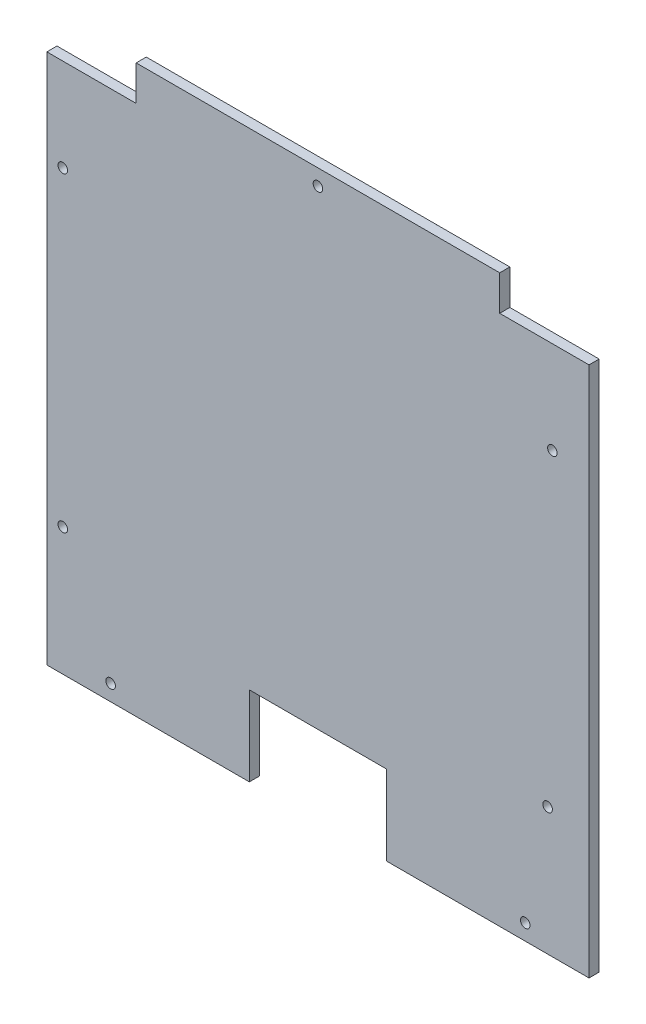
ISO-10303-21;
HEADER;
FILE_DESCRIPTION(('STEP AP214'),'2;1');
FILE_NAME('part.step','',(''),(''),'','','');
FILE_SCHEMA(('AUTOMOTIVE_DESIGN { 1 0 10303 214 1 1 1 1 }'));
ENDSEC;
DATA;
#1=APPLICATION_CONTEXT('core data for automotive mechanical design processes');
#2=APPLICATION_PROTOCOL_DEFINITION('international standard','automotive_design',2000,#1);
#3=PRODUCT_CONTEXT('',#1,'mechanical');
#4=PRODUCT('Part','Part','',(#3));
#5=PRODUCT_RELATED_PRODUCT_CATEGORY('part','',(#4));
#6=PRODUCT_DEFINITION_FORMATION('','',#4);
#7=PRODUCT_DEFINITION_CONTEXT('part definition',#1,'design');
#8=PRODUCT_DEFINITION('design','',#6,#7);
#9=PRODUCT_DEFINITION_SHAPE('','',#8);
#10=(LENGTH_UNIT() NAMED_UNIT(*) SI_UNIT(.MILLI.,.METRE.));
#11=(NAMED_UNIT(*) PLANE_ANGLE_UNIT() SI_UNIT($,.RADIAN.));
#12=(NAMED_UNIT(*) SI_UNIT($,.STERADIAN.) SOLID_ANGLE_UNIT());
#13=UNCERTAINTY_MEASURE_WITH_UNIT(LENGTH_MEASURE(1.E-05),#10,'distance_accuracy_value','');
#14=(GEOMETRIC_REPRESENTATION_CONTEXT(3) GLOBAL_UNCERTAINTY_ASSIGNED_CONTEXT((#13)) GLOBAL_UNIT_ASSIGNED_CONTEXT((#10,
#11,#12)) REPRESENTATION_CONTEXT('',''));
#15=CARTESIAN_POINT('',(0.,0.,0.));
#16=DIRECTION('',(0.,0.,1.));
#17=DIRECTION('',(1.,0.,0.));
#18=AXIS2_PLACEMENT_3D('',#15,#16,#17);
#19=CARTESIAN_POINT('',(213.,0.,6.35));
#20=DIRECTION('',(-1.,0.,0.));
#21=DIRECTION('',(0.,0.,1.));
#22=AXIS2_PLACEMENT_3D('',#19,#20,#21);
#23=PLANE('',#22);
#24=DIRECTION('',(0.,1.,0.));
#25=VECTOR('',#24,1.);
#26=CARTESIAN_POINT('',(213.,0.,0.));
#27=LINE('',#26,#25);
#28=CARTESIAN_POINT('',(213.,0.,0.));
#29=VERTEX_POINT('',#28);
#30=CARTESIAN_POINT('',(213.,50.,0.));
#31=VERTEX_POINT('',#30);
#32=EDGE_CURVE('E183',#29,#31,#27,.T.);
#33=ORIENTED_EDGE('',*,*,#32,.F.);
#34=DIRECTION('',(0.,0.,-1.));
#35=VECTOR('',#34,1.);
#36=CARTESIAN_POINT('',(213.,0.,6.35));
#37=LINE('',#36,#35);
#38=CARTESIAN_POINT('',(213.,0.,6.35));
#39=VERTEX_POINT('',#38);
#40=EDGE_CURVE('E11',#39,#29,#37,.T.);
#41=ORIENTED_EDGE('',*,*,#40,.F.);
#42=DIRECTION('',(0.,1.,0.));
#43=VECTOR('',#42,1.);
#44=CARTESIAN_POINT('',(213.,0.,6.35));
#45=LINE('',#44,#43);
#46=CARTESIAN_POINT('',(213.,50.,6.35));
#47=VERTEX_POINT('',#46);
#48=EDGE_CURVE('E312',#39,#47,#45,.T.);
#49=ORIENTED_EDGE('',*,*,#48,.T.);
#50=DIRECTION('',(0.,0.,-1.));
#51=VECTOR('',#50,1.);
#52=CARTESIAN_POINT('',(213.,50.,6.35));
#53=LINE('',#52,#51);
#54=EDGE_CURVE('E96',#47,#31,#53,.T.);
#55=ORIENTED_EDGE('',*,*,#54,.T.);
#56=EDGE_LOOP('',(#33,#41,#49,#55));
#57=FACE_BOUND('',#56,.T.);
#58=ADVANCED_FACE('F33',(#57),#23,.T.);
#59=CARTESIAN_POINT('',(0.,0.,6.35));
#60=DIRECTION('',(0.,1.,0.));
#61=DIRECTION('',(0.,0.,1.));
#62=AXIS2_PLACEMENT_3D('',#59,#60,#61);
#63=PLANE('',#62);
#64=DIRECTION('',(1.,0.,0.));
#65=VECTOR('',#64,1.);
#66=CARTESIAN_POINT('',(0.,0.,0.));
#67=LINE('',#66,#65);
#68=CARTESIAN_POINT('',(340.,0.,0.));
#69=VERTEX_POINT('',#68);
#70=EDGE_CURVE('E181',#29,#69,#67,.T.);
#71=ORIENTED_EDGE('',*,*,#70,.T.);
#72=DIRECTION('',(0.,0.,-1.));
#73=VECTOR('',#72,1.);
#74=CARTESIAN_POINT('',(340.,0.,6.35));
#75=LINE('',#74,#73);
#76=CARTESIAN_POINT('',(340.,0.,6.35));
#77=VERTEX_POINT('',#76);
#78=EDGE_CURVE('E42',#77,#69,#75,.T.);
#79=ORIENTED_EDGE('',*,*,#78,.F.);
#80=DIRECTION('',(1.,0.,0.));
#81=VECTOR('',#80,1.);
#82=CARTESIAN_POINT('',(0.,0.,6.35));
#83=LINE('',#82,#81);
#84=EDGE_CURVE('E146',#39,#77,#83,.T.);
#85=ORIENTED_EDGE('',*,*,#84,.F.);
#86=ORIENTED_EDGE('',*,*,#40,.T.);
#87=EDGE_LOOP('',(#71,#79,#85,#86));
#88=FACE_BOUND('',#87,.T.);
#89=ADVANCED_FACE('F182',(#88),#63,.F.);
#90=CARTESIAN_POINT('',(340.,0.,6.35));
#91=DIRECTION('',(-1.,0.,0.));
#92=DIRECTION('',(0.,0.,1.));
#93=AXIS2_PLACEMENT_3D('',#90,#91,#92);
#94=PLANE('',#93);
#95=DIRECTION('',(0.,1.,0.));
#96=VECTOR('',#95,1.);
#97=CARTESIAN_POINT('',(340.,0.,0.));
#98=LINE('',#97,#96);
#99=CARTESIAN_POINT('',(340.,333.,0.));
#100=VERTEX_POINT('',#99);
#101=EDGE_CURVE('E175',#69,#100,#98,.T.);
#102=ORIENTED_EDGE('',*,*,#101,.T.);
#103=DIRECTION('',(0.,0.,-1.));
#104=VECTOR('',#103,1.);
#105=CARTESIAN_POINT('',(340.,333.,6.35));
#106=LINE('',#105,#104);
#107=CARTESIAN_POINT('',(340.,333.,6.35));
#108=VERTEX_POINT('',#107);
#109=EDGE_CURVE('E166',#108,#100,#106,.T.);
#110=ORIENTED_EDGE('',*,*,#109,.F.);
#111=DIRECTION('',(0.,1.,0.));
#112=VECTOR('',#111,1.);
#113=CARTESIAN_POINT('',(340.,0.,6.35));
#114=LINE('',#113,#112);
#115=EDGE_CURVE('E177',#77,#108,#114,.T.);
#116=ORIENTED_EDGE('',*,*,#115,.F.);
#117=ORIENTED_EDGE('',*,*,#78,.T.);
#118=EDGE_LOOP('',(#102,#110,#116,#117));
#119=FACE_BOUND('',#118,.T.);
#120=ADVANCED_FACE('F173',(#119),#94,.F.);
#121=CARTESIAN_POINT('',(0.,333.,6.35));
#122=DIRECTION('',(0.,-1.,0.));
#123=DIRECTION('',(0.,0.,-1.));
#124=AXIS2_PLACEMENT_3D('',#121,#122,#123);
#125=PLANE('',#124);
#126=DIRECTION('',(-1.,0.,0.));
#127=VECTOR('',#126,1.);
#128=CARTESIAN_POINT('',(0.,333.,0.));
#129=LINE('',#128,#127);
#130=CARTESIAN_POINT('',(284.,333.,0.));
#131=VERTEX_POINT('',#130);
#132=EDGE_CURVE('E185',#100,#131,#129,.T.);
#133=ORIENTED_EDGE('',*,*,#132,.T.);
#134=DIRECTION('',(0.,0.,-1.));
#135=VECTOR('',#134,1.);
#136=CARTESIAN_POINT('',(284.,333.,6.35));
#137=LINE('',#136,#135);
#138=CARTESIAN_POINT('',(284.,333.,6.35));
#139=VERTEX_POINT('',#138);
#140=EDGE_CURVE('E164',#139,#131,#137,.T.);
#141=ORIENTED_EDGE('',*,*,#140,.F.);
#142=DIRECTION('',(-1.,0.,0.));
#143=VECTOR('',#142,1.);
#144=CARTESIAN_POINT('',(0.,333.,6.35));
#145=LINE('',#144,#143);
#146=EDGE_CURVE('E319',#108,#139,#145,.T.);
#147=ORIENTED_EDGE('',*,*,#146,.F.);
#148=ORIENTED_EDGE('',*,*,#109,.T.);
#149=EDGE_LOOP('',(#133,#141,#147,#148));
#150=FACE_BOUND('',#149,.T.);
#151=ADVANCED_FACE('F251',(#150),#125,.F.);
#152=CARTESIAN_POINT('',(284.,0.,6.35));
#153=DIRECTION('',(1.,0.,0.));
#154=DIRECTION('',(0.,0.,-1.));
#155=AXIS2_PLACEMENT_3D('',#152,#153,#154);
#156=PLANE('',#155);
#157=DIRECTION('',(0.,-1.,0.));
#158=VECTOR('',#157,1.);
#159=CARTESIAN_POINT('',(284.,0.,0.));
#160=LINE('',#159,#158);
#161=CARTESIAN_POINT('',(284.,355.,0.));
#162=VERTEX_POINT('',#161);
#163=EDGE_CURVE('E341',#162,#131,#160,.T.);
#164=ORIENTED_EDGE('',*,*,#163,.F.);
#165=DIRECTION('',(0.,0.,-1.));
#166=VECTOR('',#165,1.);
#167=CARTESIAN_POINT('',(284.,355.,6.35));
#168=LINE('',#167,#166);
#169=CARTESIAN_POINT('',(284.,355.,6.35));
#170=VERTEX_POINT('',#169);
#171=EDGE_CURVE('E162',#170,#162,#168,.T.);
#172=ORIENTED_EDGE('',*,*,#171,.F.);
#173=DIRECTION('',(0.,-1.,0.));
#174=VECTOR('',#173,1.);
#175=CARTESIAN_POINT('',(284.,0.,6.35));
#176=LINE('',#175,#174);
#177=EDGE_CURVE('E321',#170,#139,#176,.T.);
#178=ORIENTED_EDGE('',*,*,#177,.T.);
#179=ORIENTED_EDGE('',*,*,#140,.T.);
#180=EDGE_LOOP('',(#164,#172,#178,#179));
#181=FACE_BOUND('',#180,.T.);
#182=ADVANCED_FACE('F254',(#181),#156,.T.);
#183=CARTESIAN_POINT('',(0.,355.,6.35));
#184=DIRECTION('',(0.,1.,0.));
#185=DIRECTION('',(0.,0.,1.));
#186=AXIS2_PLACEMENT_3D('',#183,#184,#185);
#187=PLANE('',#186);
#188=DIRECTION('',(1.,0.,0.));
#189=VECTOR('',#188,1.);
#190=CARTESIAN_POINT('',(0.,355.,0.));
#191=LINE('',#190,#189);
#192=CARTESIAN_POINT('',(56.,355.,0.));
#193=VERTEX_POINT('',#192);
#194=EDGE_CURVE('E338',#193,#162,#191,.T.);
#195=ORIENTED_EDGE('',*,*,#194,.F.);
#196=DIRECTION('',(0.,0.,-1.));
#197=VECTOR('',#196,1.);
#198=CARTESIAN_POINT('',(56.,355.,6.35));
#199=LINE('',#198,#197);
#200=CARTESIAN_POINT('',(56.,355.,6.35));
#201=VERTEX_POINT('',#200);
#202=EDGE_CURVE('E160',#201,#193,#199,.T.);
#203=ORIENTED_EDGE('',*,*,#202,.F.);
#204=DIRECTION('',(1.,0.,0.));
#205=VECTOR('',#204,1.);
#206=CARTESIAN_POINT('',(0.,355.,6.35));
#207=LINE('',#206,#205);
#208=EDGE_CURVE('E324',#201,#170,#207,.T.);
#209=ORIENTED_EDGE('',*,*,#208,.T.);
#210=ORIENTED_EDGE('',*,*,#171,.T.);
#211=EDGE_LOOP('',(#195,#203,#209,#210));
#212=FACE_BOUND('',#211,.T.);
#213=ADVANCED_FACE('F258',(#212),#187,.T.);
#214=CARTESIAN_POINT('',(56.,0.,6.35));
#215=DIRECTION('',(1.,0.,0.));
#216=DIRECTION('',(0.,0.,-1.));
#217=AXIS2_PLACEMENT_3D('',#214,#215,#216);
#218=PLANE('',#217);
#219=DIRECTION('',(0.,-1.,0.));
#220=VECTOR('',#219,1.);
#221=CARTESIAN_POINT('',(56.,0.,0.));
#222=LINE('',#221,#220);
#223=CARTESIAN_POINT('',(56.,333.,0.));
#224=VERTEX_POINT('',#223);
#225=EDGE_CURVE('E197',#193,#224,#222,.T.);
#226=ORIENTED_EDGE('',*,*,#225,.T.);
#227=DIRECTION('',(0.,0.,-1.));
#228=VECTOR('',#227,1.);
#229=CARTESIAN_POINT('',(56.,333.,6.35));
#230=LINE('',#229,#228);
#231=CARTESIAN_POINT('',(56.,333.,6.35));
#232=VERTEX_POINT('',#231);
#233=EDGE_CURVE('E158',#232,#224,#230,.T.);
#234=ORIENTED_EDGE('',*,*,#233,.F.);
#235=DIRECTION('',(0.,-1.,0.));
#236=VECTOR('',#235,1.);
#237=CARTESIAN_POINT('',(56.,0.,6.35));
#238=LINE('',#237,#236);
#239=EDGE_CURVE('E327',#201,#232,#238,.T.);
#240=ORIENTED_EDGE('',*,*,#239,.F.);
#241=ORIENTED_EDGE('',*,*,#202,.T.);
#242=EDGE_LOOP('',(#226,#234,#240,#241));
#243=FACE_BOUND('',#242,.T.);
#244=ADVANCED_FACE('F262',(#243),#218,.F.);
#245=CARTESIAN_POINT('',(0.,333.,6.35));
#246=DIRECTION('',(0.,1.,0.));
#247=DIRECTION('',(0.,0.,1.));
#248=AXIS2_PLACEMENT_3D('',#245,#246,#247);
#249=PLANE('',#248);
#250=DIRECTION('',(1.,0.,0.));
#251=VECTOR('',#250,1.);
#252=CARTESIAN_POINT('',(0.,333.,0.));
#253=LINE('',#252,#251);
#254=CARTESIAN_POINT('',(0.,333.,0.));
#255=VERTEX_POINT('',#254);
#256=EDGE_CURVE('E193',#255,#224,#253,.T.);
#257=ORIENTED_EDGE('',*,*,#256,.F.);
#258=DIRECTION('',(0.,0.,-1.));
#259=VECTOR('',#258,1.);
#260=CARTESIAN_POINT('',(0.,333.,6.35));
#261=LINE('',#260,#259);
#262=CARTESIAN_POINT('',(0.,333.,6.35));
#263=VERTEX_POINT('',#262);
#264=EDGE_CURVE('E152',#263,#255,#261,.T.);
#265=ORIENTED_EDGE('',*,*,#264,.F.);
#266=DIRECTION('',(1.,0.,0.));
#267=VECTOR('',#266,1.);
#268=CARTESIAN_POINT('',(0.,333.,6.35));
#269=LINE('',#268,#267);
#270=EDGE_CURVE('E329',#263,#232,#269,.T.);
#271=ORIENTED_EDGE('',*,*,#270,.T.);
#272=ORIENTED_EDGE('',*,*,#233,.T.);
#273=EDGE_LOOP('',(#257,#265,#271,#272));
#274=FACE_BOUND('',#273,.T.);
#275=ADVANCED_FACE('F266',(#274),#249,.T.);
#276=CARTESIAN_POINT('',(0.,0.,6.35));
#277=DIRECTION('',(-1.,0.,0.));
#278=DIRECTION('',(0.,0.,1.));
#279=AXIS2_PLACEMENT_3D('',#276,#277,#278);
#280=PLANE('',#279);
#281=DIRECTION('',(0.,1.,0.));
#282=VECTOR('',#281,1.);
#283=CARTESIAN_POINT('',(0.,0.,0.));
#284=LINE('',#283,#282);
#285=CARTESIAN_POINT('',(0.,0.,0.));
#286=VERTEX_POINT('',#285);
#287=EDGE_CURVE('E190',#286,#255,#284,.T.);
#288=ORIENTED_EDGE('',*,*,#287,.F.);
#289=DIRECTION('',(0.,0.,-1.));
#290=VECTOR('',#289,1.);
#291=CARTESIAN_POINT('',(0.,0.,6.35));
#292=LINE('',#291,#290);
#293=CARTESIAN_POINT('',(0.,0.,6.35));
#294=VERTEX_POINT('',#293);
#295=EDGE_CURVE('E150',#294,#286,#292,.T.);
#296=ORIENTED_EDGE('',*,*,#295,.F.);
#297=DIRECTION('',(0.,1.,0.));
#298=VECTOR('',#297,1.);
#299=CARTESIAN_POINT('',(0.,0.,6.35));
#300=LINE('',#299,#298);
#301=EDGE_CURVE('E143',#294,#263,#300,.T.);
#302=ORIENTED_EDGE('',*,*,#301,.T.);
#303=ORIENTED_EDGE('',*,*,#264,.T.);
#304=EDGE_LOOP('',(#288,#296,#302,#303));
#305=FACE_BOUND('',#304,.T.);
#306=ADVANCED_FACE('F270',(#305),#280,.T.);
#307=CARTESIAN_POINT('',(127.,0.,0.));
#308=VERTEX_POINT('',#307);
#309=EDGE_CURVE('E149',#286,#308,#67,.T.);
#310=ORIENTED_EDGE('',*,*,#309,.T.);
#311=DIRECTION('',(0.,0.,-1.));
#312=VECTOR('',#311,1.);
#313=CARTESIAN_POINT('',(127.,0.,6.35));
#314=LINE('',#313,#312);
#315=CARTESIAN_POINT('',(127.,0.,6.35));
#316=VERTEX_POINT('',#315);
#317=EDGE_CURVE('E133',#316,#308,#314,.T.);
#318=ORIENTED_EDGE('',*,*,#317,.F.);
#319=EDGE_CURVE('E136',#294,#316,#83,.T.);
#320=ORIENTED_EDGE('',*,*,#319,.F.);
#321=ORIENTED_EDGE('',*,*,#295,.T.);
#322=EDGE_LOOP('',(#310,#318,#320,#321));
#323=FACE_BOUND('',#322,.T.);
#324=ADVANCED_FACE('F147',(#323),#63,.F.);
#325=CARTESIAN_POINT('',(127.,0.,6.35));
#326=DIRECTION('',(-1.,0.,0.));
#327=DIRECTION('',(0.,0.,1.));
#328=AXIS2_PLACEMENT_3D('',#325,#326,#327);
#329=PLANE('',#328);
#330=DIRECTION('',(0.,1.,0.));
#331=VECTOR('',#330,1.);
#332=CARTESIAN_POINT('',(127.,0.,0.));
#333=LINE('',#332,#331);
#334=CARTESIAN_POINT('',(127.,50.,0.));
#335=VERTEX_POINT('',#334);
#336=EDGE_CURVE('E189',#308,#335,#333,.T.);
#337=ORIENTED_EDGE('',*,*,#336,.T.);
#338=DIRECTION('',(0.,0.,-1.));
#339=VECTOR('',#338,1.);
#340=CARTESIAN_POINT('',(127.,50.,6.35));
#341=LINE('',#340,#339);
#342=CARTESIAN_POINT('',(127.,50.,6.35));
#343=VERTEX_POINT('',#342);
#344=EDGE_CURVE('E135',#343,#335,#341,.T.);
#345=ORIENTED_EDGE('',*,*,#344,.F.);
#346=DIRECTION('',(0.,1.,0.));
#347=VECTOR('',#346,1.);
#348=CARTESIAN_POINT('',(127.,0.,6.35));
#349=LINE('',#348,#347);
#350=EDGE_CURVE('E128',#316,#343,#349,.T.);
#351=ORIENTED_EDGE('',*,*,#350,.F.);
#352=ORIENTED_EDGE('',*,*,#317,.T.);
#353=EDGE_LOOP('',(#337,#345,#351,#352));
#354=FACE_BOUND('',#353,.T.);
#355=ADVANCED_FACE('F131',(#354),#329,.F.);
#356=CARTESIAN_POINT('',(40.,10.,6.35));
#357=DIRECTION('',(0.,0.,-1.));
#358=DIRECTION('',(-1.,0.,0.));
#359=AXIS2_PLACEMENT_3D('',#356,#357,#358);
#360=CYLINDRICAL_SURFACE('',#359,2.99999999999999);
#361=CARTESIAN_POINT('',(40.,10.,6.35));
#362=DIRECTION('',(0.,0.,1.));
#363=DIRECTION('',(1.,0.,0.));
#364=AXIS2_PLACEMENT_3D('',#361,#362,#363);
#365=CIRCLE('',#364,2.99999999999999);
#366=CARTESIAN_POINT('',(43.,10.,6.35));
#367=VERTEX_POINT('',#366);
#368=EDGE_CURVE('E311',#367,#367,#365,.T.);
#369=ORIENTED_EDGE('',*,*,#368,.T.);
#370=EDGE_LOOP('',(#369));
#371=FACE_BOUND('',#370,.T.);
#372=CARTESIAN_POINT('',(40.,10.,0.));
#373=DIRECTION('',(0.,0.,1.));
#374=DIRECTION('',(1.,0.,0.));
#375=AXIS2_PLACEMENT_3D('',#372,#373,#374);
#376=CIRCLE('',#375,2.99999999999999);
#377=CARTESIAN_POINT('',(43.,10.,0.));
#378=VERTEX_POINT('',#377);
#379=EDGE_CURVE('E187',#378,#378,#376,.T.);
#380=ORIENTED_EDGE('',*,*,#379,.F.);
#381=EDGE_LOOP('',(#380));
#382=FACE_BOUND('',#381,.T.);
#383=ADVANCED_FACE('F228',(#371,#382),#360,.F.);
#384=CARTESIAN_POINT('',(300.,10.,6.35));
#385=DIRECTION('',(0.,0.,-1.));
#386=DIRECTION('',(-1.,0.,0.));
#387=AXIS2_PLACEMENT_3D('',#384,#385,#386);
#388=CYLINDRICAL_SURFACE('',#387,2.99999999999999);
#389=CARTESIAN_POINT('',(300.,10.,6.35));
#390=DIRECTION('',(0.,0.,1.));
#391=DIRECTION('',(1.,0.,0.));
#392=AXIS2_PLACEMENT_3D('',#389,#390,#391);
#393=CIRCLE('',#392,2.99999999999999);
#394=CARTESIAN_POINT('',(303.,10.,6.35));
#395=VERTEX_POINT('',#394);
#396=EDGE_CURVE('E309',#395,#395,#393,.T.);
#397=ORIENTED_EDGE('',*,*,#396,.T.);
#398=EDGE_LOOP('',(#397));
#399=FACE_BOUND('',#398,.T.);
#400=CARTESIAN_POINT('',(300.,10.,0.));
#401=DIRECTION('',(0.,0.,1.));
#402=DIRECTION('',(1.,0.,0.));
#403=AXIS2_PLACEMENT_3D('',#400,#401,#402);
#404=CIRCLE('',#403,2.99999999999999);
#405=CARTESIAN_POINT('',(303.,10.,0.));
#406=VERTEX_POINT('',#405);
#407=EDGE_CURVE('E220',#406,#406,#404,.T.);
#408=ORIENTED_EDGE('',*,*,#407,.F.);
#409=EDGE_LOOP('',(#408));
#410=FACE_BOUND('',#409,.T.);
#411=ADVANCED_FACE('F230',(#399,#410),#388,.F.);
#412=CARTESIAN_POINT('',(170.,345.,6.35));
#413=DIRECTION('',(0.,0.,-1.));
#414=DIRECTION('',(-1.,0.,0.));
#415=AXIS2_PLACEMENT_3D('',#412,#413,#414);
#416=CYLINDRICAL_SURFACE('',#415,3.00000000000002);
#417=CARTESIAN_POINT('',(170.,345.,6.35));
#418=DIRECTION('',(0.,0.,1.));
#419=DIRECTION('',(1.,0.,0.));
#420=AXIS2_PLACEMENT_3D('',#417,#418,#419);
#421=CIRCLE('',#420,3.00000000000002);
#422=CARTESIAN_POINT('',(173.,345.,6.35));
#423=VERTEX_POINT('',#422);
#424=EDGE_CURVE('E305',#423,#423,#421,.T.);
#425=ORIENTED_EDGE('',*,*,#424,.T.);
#426=EDGE_LOOP('',(#425));
#427=FACE_BOUND('',#426,.T.);
#428=CARTESIAN_POINT('',(170.,345.,0.));
#429=DIRECTION('',(0.,0.,1.));
#430=DIRECTION('',(1.,0.,0.));
#431=AXIS2_PLACEMENT_3D('',#428,#429,#430);
#432=CIRCLE('',#431,3.00000000000002);
#433=CARTESIAN_POINT('',(173.,345.,0.));
#434=VERTEX_POINT('',#433);
#435=EDGE_CURVE('E217',#434,#434,#432,.T.);
#436=ORIENTED_EDGE('',*,*,#435,.F.);
#437=EDGE_LOOP('',(#436));
#438=FACE_BOUND('',#437,.T.);
#439=ADVANCED_FACE('F237',(#427,#438),#416,.F.);
#440=CARTESIAN_POINT('',(10.,275.,6.35));
#441=DIRECTION('',(0.,0.,-1.));
#442=DIRECTION('',(-1.,0.,0.));
#443=AXIS2_PLACEMENT_3D('',#440,#441,#442);
#444=CYLINDRICAL_SURFACE('',#443,3.);
#445=CARTESIAN_POINT('',(10.,275.,6.35));
#446=DIRECTION('',(0.,0.,1.));
#447=DIRECTION('',(1.,0.,0.));
#448=AXIS2_PLACEMENT_3D('',#445,#446,#447);
#449=CIRCLE('',#448,3.);
#450=CARTESIAN_POINT('',(13.,275.,6.35));
#451=VERTEX_POINT('',#450);
#452=EDGE_CURVE('E301',#451,#451,#449,.T.);
#453=ORIENTED_EDGE('',*,*,#452,.T.);
#454=EDGE_LOOP('',(#453));
#455=FACE_BOUND('',#454,.T.);
#456=CARTESIAN_POINT('',(10.,275.,0.));
#457=DIRECTION('',(0.,0.,1.));
#458=DIRECTION('',(1.,0.,0.));
#459=AXIS2_PLACEMENT_3D('',#456,#457,#458);
#460=CIRCLE('',#459,3.);
#461=CARTESIAN_POINT('',(13.,275.,0.));
#462=VERTEX_POINT('',#461);
#463=EDGE_CURVE('E214',#462,#462,#460,.T.);
#464=ORIENTED_EDGE('',*,*,#463,.F.);
#465=EDGE_LOOP('',(#464));
#466=FACE_BOUND('',#465,.T.);
#467=ADVANCED_FACE('F371',(#455,#466),#444,.F.);
#468=CARTESIAN_POINT('',(10.,80.,6.35));
#469=DIRECTION('',(0.,0.,-1.));
#470=DIRECTION('',(-1.,0.,0.));
#471=AXIS2_PLACEMENT_3D('',#468,#469,#470);
#472=CYLINDRICAL_SURFACE('',#471,2.99999999999999);
#473=CARTESIAN_POINT('',(10.,80.,6.35));
#474=DIRECTION('',(0.,0.,1.));
#475=DIRECTION('',(1.,0.,0.));
#476=AXIS2_PLACEMENT_3D('',#473,#474,#475);
#477=CIRCLE('',#476,2.99999999999999);
#478=CARTESIAN_POINT('',(13.,80.,6.35));
#479=VERTEX_POINT('',#478);
#480=EDGE_CURVE('E297',#479,#479,#477,.T.);
#481=ORIENTED_EDGE('',*,*,#480,.T.);
#482=EDGE_LOOP('',(#481));
#483=FACE_BOUND('',#482,.T.);
#484=CARTESIAN_POINT('',(10.,80.,0.));
#485=DIRECTION('',(0.,0.,1.));
#486=DIRECTION('',(1.,0.,0.));
#487=AXIS2_PLACEMENT_3D('',#484,#485,#486);
#488=CIRCLE('',#487,2.99999999999999);
#489=CARTESIAN_POINT('',(13.,80.,0.));
#490=VERTEX_POINT('',#489);
#491=EDGE_CURVE('E211',#490,#490,#488,.T.);
#492=ORIENTED_EDGE('',*,*,#491,.F.);
#493=EDGE_LOOP('',(#492));
#494=FACE_BOUND('',#493,.T.);
#495=ADVANCED_FACE('F377',(#483,#494),#472,.F.);
#496=CARTESIAN_POINT('',(317.023307373129,275.,6.35));
#497=DIRECTION('',(0.,0.,-1.));
#498=DIRECTION('',(-1.,0.,0.));
#499=AXIS2_PLACEMENT_3D('',#496,#497,#498);
#500=CYLINDRICAL_SURFACE('',#499,2.99999999999999);
#501=CARTESIAN_POINT('',(317.023307373129,275.,6.35));
#502=DIRECTION('',(0.,0.,1.));
#503=DIRECTION('',(1.,0.,0.));
#504=AXIS2_PLACEMENT_3D('',#501,#502,#503);
#505=CIRCLE('',#504,2.99999999999999);
#506=CARTESIAN_POINT('',(320.023307373129,275.,6.35));
#507=VERTEX_POINT('',#506);
#508=EDGE_CURVE('E293',#507,#507,#505,.T.);
#509=ORIENTED_EDGE('',*,*,#508,.T.);
#510=EDGE_LOOP('',(#509));
#511=FACE_BOUND('',#510,.T.);
#512=CARTESIAN_POINT('',(317.023307373129,275.,0.));
#513=DIRECTION('',(0.,0.,1.));
#514=DIRECTION('',(1.,0.,0.));
#515=AXIS2_PLACEMENT_3D('',#512,#513,#514);
#516=CIRCLE('',#515,2.99999999999999);
#517=CARTESIAN_POINT('',(320.023307373129,275.,0.));
#518=VERTEX_POINT('',#517);
#519=EDGE_CURVE('E208',#518,#518,#516,.T.);
#520=ORIENTED_EDGE('',*,*,#519,.F.);
#521=EDGE_LOOP('',(#520));
#522=FACE_BOUND('',#521,.T.);
#523=ADVANCED_FACE('F356',(#511,#522),#500,.F.);
#524=CARTESIAN_POINT('',(314.023307373129,80.,6.35));
#525=DIRECTION('',(0.,0.,-1.));
#526=DIRECTION('',(-1.,0.,0.));
#527=AXIS2_PLACEMENT_3D('',#524,#525,#526);
#528=CYLINDRICAL_SURFACE('',#527,2.99999999999999);
#529=CARTESIAN_POINT('',(314.023307373129,80.,6.35));
#530=DIRECTION('',(0.,0.,1.));
#531=DIRECTION('',(1.,0.,0.));
#532=AXIS2_PLACEMENT_3D('',#529,#530,#531);
#533=CIRCLE('',#532,2.99999999999999);
#534=CARTESIAN_POINT('',(317.023307373129,80.,6.35));
#535=VERTEX_POINT('',#534);
#536=EDGE_CURVE('E201',#535,#535,#533,.T.);
#537=ORIENTED_EDGE('',*,*,#536,.T.);
#538=EDGE_LOOP('',(#537));
#539=FACE_BOUND('',#538,.T.);
#540=CARTESIAN_POINT('',(314.023307373129,80.,0.));
#541=DIRECTION('',(0.,0.,1.));
#542=DIRECTION('',(1.,0.,0.));
#543=AXIS2_PLACEMENT_3D('',#540,#541,#542);
#544=CIRCLE('',#543,2.99999999999999);
#545=CARTESIAN_POINT('',(317.023307373129,80.,0.));
#546=VERTEX_POINT('',#545);
#547=EDGE_CURVE('E205',#546,#546,#544,.T.);
#548=ORIENTED_EDGE('',*,*,#547,.F.);
#549=EDGE_LOOP('',(#548));
#550=FACE_BOUND('',#549,.T.);
#551=ADVANCED_FACE('F35',(#539,#550),#528,.F.);
#552=CARTESIAN_POINT('',(0.,50.,6.35));
#553=DIRECTION('',(0.,1.,0.));
#554=DIRECTION('',(0.,0.,1.));
#555=AXIS2_PLACEMENT_3D('',#552,#553,#554);
#556=PLANE('',#555);
#557=DIRECTION('',(1.,0.,0.));
#558=VECTOR('',#557,1.);
#559=CARTESIAN_POINT('',(0.,50.,0.));
#560=LINE('',#559,#558);
#561=EDGE_CURVE('E89',#335,#31,#560,.T.);
#562=ORIENTED_EDGE('',*,*,#561,.T.);
#563=ORIENTED_EDGE('',*,*,#54,.F.);
#564=DIRECTION('',(1.,0.,0.));
#565=VECTOR('',#564,1.);
#566=CARTESIAN_POINT('',(0.,50.,6.35));
#567=LINE('',#566,#565);
#568=EDGE_CURVE('E50',#343,#47,#567,.T.);
#569=ORIENTED_EDGE('',*,*,#568,.F.);
#570=ORIENTED_EDGE('',*,*,#344,.T.);
#571=EDGE_LOOP('',(#562,#563,#569,#570));
#572=FACE_BOUND('',#571,.T.);
#573=ADVANCED_FACE('F276',(#572),#556,.F.);
#574=CARTESIAN_POINT('',(0.,0.,6.35));
#575=DIRECTION('',(0.,0.,1.));
#576=DIRECTION('',(1.,0.,0.));
#577=AXIS2_PLACEMENT_3D('',#574,#575,#576);
#578=PLANE('',#577);
#579=ORIENTED_EDGE('',*,*,#536,.F.);
#580=EDGE_LOOP('',(#579));
#581=FACE_BOUND('',#580,.T.);
#582=ORIENTED_EDGE('',*,*,#508,.F.);
#583=EDGE_LOOP('',(#582));
#584=FACE_BOUND('',#583,.T.);
#585=ORIENTED_EDGE('',*,*,#480,.F.);
#586=EDGE_LOOP('',(#585));
#587=FACE_BOUND('',#586,.T.);
#588=ORIENTED_EDGE('',*,*,#452,.F.);
#589=EDGE_LOOP('',(#588));
#590=FACE_BOUND('',#589,.T.);
#591=ORIENTED_EDGE('',*,*,#424,.F.);
#592=EDGE_LOOP('',(#591));
#593=FACE_BOUND('',#592,.T.);
#594=ORIENTED_EDGE('',*,*,#396,.F.);
#595=EDGE_LOOP('',(#594));
#596=FACE_BOUND('',#595,.T.);
#597=ORIENTED_EDGE('',*,*,#368,.F.);
#598=EDGE_LOOP('',(#597));
#599=FACE_BOUND('',#598,.T.);
#600=ORIENTED_EDGE('',*,*,#48,.F.);
#601=ORIENTED_EDGE('',*,*,#84,.T.);
#602=ORIENTED_EDGE('',*,*,#115,.T.);
#603=ORIENTED_EDGE('',*,*,#146,.T.);
#604=ORIENTED_EDGE('',*,*,#177,.F.);
#605=ORIENTED_EDGE('',*,*,#208,.F.);
#606=ORIENTED_EDGE('',*,*,#239,.T.);
#607=ORIENTED_EDGE('',*,*,#270,.F.);
#608=ORIENTED_EDGE('',*,*,#301,.F.);
#609=ORIENTED_EDGE('',*,*,#319,.T.);
#610=ORIENTED_EDGE('',*,*,#350,.T.);
#611=ORIENTED_EDGE('',*,*,#568,.T.);
#612=EDGE_LOOP('',(#600,#601,#602,#603,#604,#605,#606,#607,#608,#609,#610,#611));
#613=FACE_BOUND('',#612,.T.);
#614=ADVANCED_FACE('F140',(#581,#584,#587,#590,#593,#596,#599,#613),#578,.T.);
#615=CARTESIAN_POINT('',(0.,0.,0.));
#616=DIRECTION('',(0.,0.,1.));
#617=DIRECTION('',(1.,0.,0.));
#618=AXIS2_PLACEMENT_3D('',#615,#616,#617);
#619=PLANE('',#618);
#620=ORIENTED_EDGE('',*,*,#547,.T.);
#621=EDGE_LOOP('',(#620));
#622=FACE_BOUND('',#621,.T.);
#623=ORIENTED_EDGE('',*,*,#519,.T.);
#624=EDGE_LOOP('',(#623));
#625=FACE_BOUND('',#624,.T.);
#626=ORIENTED_EDGE('',*,*,#491,.T.);
#627=EDGE_LOOP('',(#626));
#628=FACE_BOUND('',#627,.T.);
#629=ORIENTED_EDGE('',*,*,#463,.T.);
#630=EDGE_LOOP('',(#629));
#631=FACE_BOUND('',#630,.T.);
#632=ORIENTED_EDGE('',*,*,#435,.T.);
#633=EDGE_LOOP('',(#632));
#634=FACE_BOUND('',#633,.T.);
#635=ORIENTED_EDGE('',*,*,#407,.T.);
#636=EDGE_LOOP('',(#635));
#637=FACE_BOUND('',#636,.T.);
#638=ORIENTED_EDGE('',*,*,#379,.T.);
#639=EDGE_LOOP('',(#638));
#640=FACE_BOUND('',#639,.T.);
#641=ORIENTED_EDGE('',*,*,#32,.T.);
#642=ORIENTED_EDGE('',*,*,#561,.F.);
#643=ORIENTED_EDGE('',*,*,#336,.F.);
#644=ORIENTED_EDGE('',*,*,#309,.F.);
#645=ORIENTED_EDGE('',*,*,#287,.T.);
#646=ORIENTED_EDGE('',*,*,#256,.T.);
#647=ORIENTED_EDGE('',*,*,#225,.F.);
#648=ORIENTED_EDGE('',*,*,#194,.T.);
#649=ORIENTED_EDGE('',*,*,#163,.T.);
#650=ORIENTED_EDGE('',*,*,#132,.F.);
#651=ORIENTED_EDGE('',*,*,#101,.F.);
#652=ORIENTED_EDGE('',*,*,#70,.F.);
#653=EDGE_LOOP('',(#641,#642,#643,#644,#645,#646,#647,#648,#649,#650,#651,#652));
#654=FACE_BOUND('',#653,.T.);
#655=ADVANCED_FACE('F226',(#622,#625,#628,#631,#634,#637,#640,#654),#619,.F.);
#656=CLOSED_SHELL('',(#58,#89,#120,#151,#182,#213,#244,#275,#306,#324,#355,#383,#411,#439,#467,
#495,#523,#551,#573,#614,#655));
#657=MANIFOLD_SOLID_BREP('B2',#656);
#658=ADVANCED_BREP_SHAPE_REPRESENTATION('',(#18,#657),#14);
#659=SHAPE_DEFINITION_REPRESENTATION(#9,#658);
ENDSEC;
END-ISO-10303-21;
